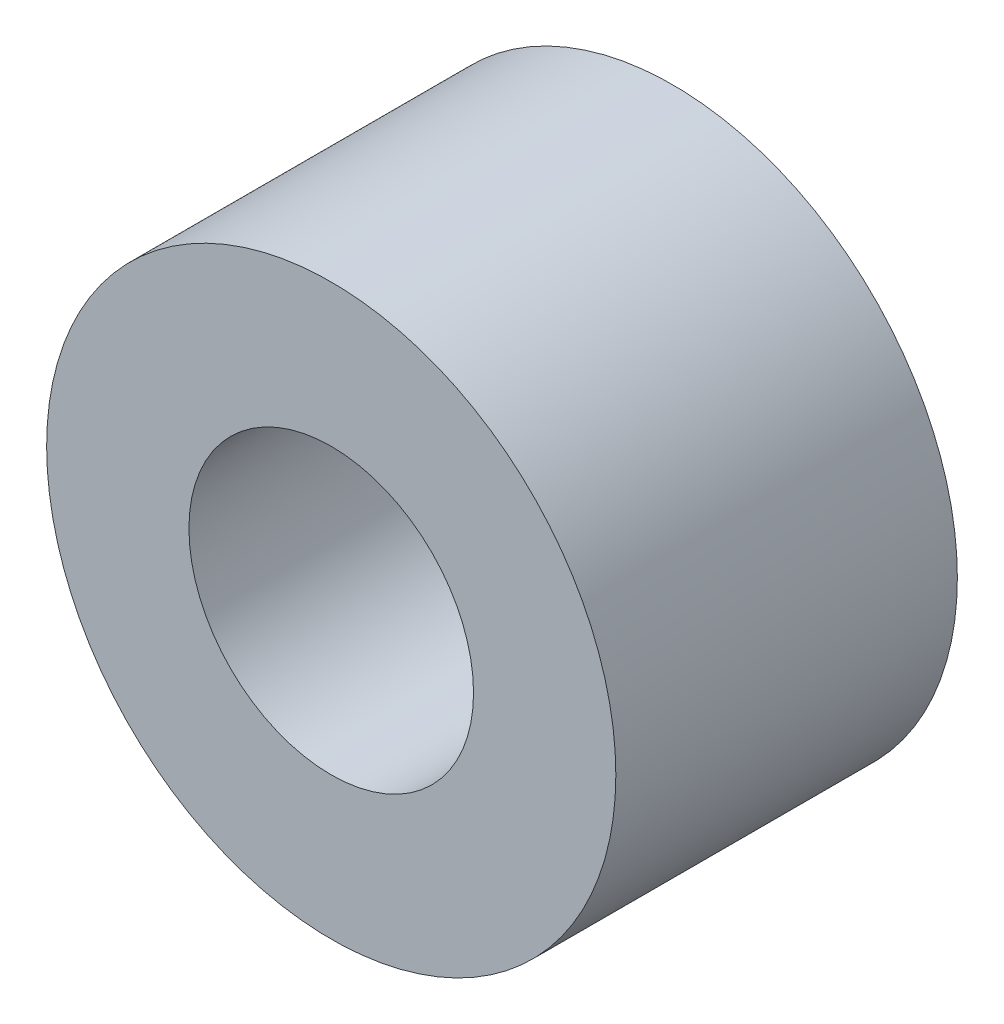
ISO-10303-21;
HEADER;
FILE_DESCRIPTION(('STEP AP214'),'2;1');
FILE_NAME('part.step','',(''),(''),'','','');
FILE_SCHEMA(('AUTOMOTIVE_DESIGN { 1 0 10303 214 1 1 1 1 }'));
ENDSEC;
DATA;
#1=APPLICATION_CONTEXT('core data for automotive mechanical design processes');
#2=APPLICATION_PROTOCOL_DEFINITION('international standard','automotive_design',2000,#1);
#3=PRODUCT_CONTEXT('',#1,'mechanical');
#4=PRODUCT('Part','Part','',(#3));
#5=PRODUCT_RELATED_PRODUCT_CATEGORY('part','',(#4));
#6=PRODUCT_DEFINITION_FORMATION('','',#4);
#7=PRODUCT_DEFINITION_CONTEXT('part definition',#1,'design');
#8=PRODUCT_DEFINITION('design','',#6,#7);
#9=PRODUCT_DEFINITION_SHAPE('','',#8);
#10=(LENGTH_UNIT() NAMED_UNIT(*) SI_UNIT(.MILLI.,.METRE.));
#11=(NAMED_UNIT(*) PLANE_ANGLE_UNIT() SI_UNIT($,.RADIAN.));
#12=(NAMED_UNIT(*) SI_UNIT($,.STERADIAN.) SOLID_ANGLE_UNIT());
#13=UNCERTAINTY_MEASURE_WITH_UNIT(LENGTH_MEASURE(1.E-05),#10,'distance_accuracy_value','');
#14=(GEOMETRIC_REPRESENTATION_CONTEXT(3) GLOBAL_UNCERTAINTY_ASSIGNED_CONTEXT((#13)) GLOBAL_UNIT_ASSIGNED_CONTEXT((#10,
#11,#12)) REPRESENTATION_CONTEXT('',''));
#15=CARTESIAN_POINT('',(0.,0.,0.));
#16=DIRECTION('',(0.,0.,1.));
#17=DIRECTION('',(1.,0.,0.));
#18=AXIS2_PLACEMENT_3D('',#15,#16,#17);
#19=CARTESIAN_POINT('',(0.,0.,6.));
#20=DIRECTION('',(0.,0.,1.));
#21=DIRECTION('',(1.,0.,0.));
#22=AXIS2_PLACEMENT_3D('',#19,#20,#21);
#23=PLANE('',#22);
#24=CARTESIAN_POINT('',(0.,0.,6.));
#25=DIRECTION('',(0.,0.,1.));
#26=DIRECTION('',(1.,0.,0.));
#27=AXIS2_PLACEMENT_3D('',#24,#25,#26);
#28=CIRCLE('',#27,5.);
#29=CARTESIAN_POINT('',(5.,0.,6.));
#30=VERTEX_POINT('',#29);
#31=EDGE_CURVE('E10',#30,#30,#28,.T.);
#32=ORIENTED_EDGE('',*,*,#31,.T.);
#33=EDGE_LOOP('',(#32));
#34=FACE_BOUND('',#33,.T.);
#35=CARTESIAN_POINT('',(0.,0.,6.));
#36=DIRECTION('',(0.,0.,1.));
#37=DIRECTION('',(1.,0.,0.));
#38=AXIS2_PLACEMENT_3D('',#35,#36,#37);
#39=CIRCLE('',#38,2.5);
#40=CARTESIAN_POINT('',(2.5,0.,6.));
#41=VERTEX_POINT('',#40);
#42=EDGE_CURVE('E45',#41,#41,#39,.T.);
#43=ORIENTED_EDGE('',*,*,#42,.F.);
#44=EDGE_LOOP('',(#43));
#45=FACE_BOUND('',#44,.T.);
#46=ADVANCED_FACE('F34',(#34,#45),#23,.T.);
#47=CARTESIAN_POINT('',(0.,0.,0.));
#48=DIRECTION('',(0.,0.,1.));
#49=DIRECTION('',(1.,0.,0.));
#50=AXIS2_PLACEMENT_3D('',#47,#48,#49);
#51=PLANE('',#50);
#52=CARTESIAN_POINT('',(0.,0.,0.));
#53=DIRECTION('',(0.,0.,1.));
#54=DIRECTION('',(1.,0.,0.));
#55=AXIS2_PLACEMENT_3D('',#52,#53,#54);
#56=CIRCLE('',#55,5.);
#57=CARTESIAN_POINT('',(5.,0.,0.));
#58=VERTEX_POINT('',#57);
#59=EDGE_CURVE('E38',#58,#58,#56,.T.);
#60=ORIENTED_EDGE('',*,*,#59,.F.);
#61=EDGE_LOOP('',(#60));
#62=FACE_BOUND('',#61,.T.);
#63=CARTESIAN_POINT('',(0.,0.,0.));
#64=DIRECTION('',(0.,0.,1.));
#65=DIRECTION('',(1.,0.,0.));
#66=AXIS2_PLACEMENT_3D('',#63,#64,#65);
#67=CIRCLE('',#66,2.5);
#68=CARTESIAN_POINT('',(2.5,0.,0.));
#69=VERTEX_POINT('',#68);
#70=EDGE_CURVE('E47',#69,#69,#67,.T.);
#71=ORIENTED_EDGE('',*,*,#70,.T.);
#72=EDGE_LOOP('',(#71));
#73=FACE_BOUND('',#72,.T.);
#74=ADVANCED_FACE('F57',(#62,#73),#51,.F.);
#75=CARTESIAN_POINT('',(0.,0.,6.));
#76=DIRECTION('',(0.,0.,-1.));
#77=DIRECTION('',(-1.,0.,0.));
#78=AXIS2_PLACEMENT_3D('',#75,#76,#77);
#79=CYLINDRICAL_SURFACE('',#78,5.);
#80=ORIENTED_EDGE('',*,*,#31,.F.);
#81=EDGE_LOOP('',(#80));
#82=FACE_BOUND('',#81,.T.);
#83=ORIENTED_EDGE('',*,*,#59,.T.);
#84=EDGE_LOOP('',(#83));
#85=FACE_BOUND('',#84,.T.);
#86=ADVANCED_FACE('F36',(#82,#85),#79,.T.);
#87=CARTESIAN_POINT('',(0.,0.,6.));
#88=DIRECTION('',(0.,0.,-1.));
#89=DIRECTION('',(-1.,0.,0.));
#90=AXIS2_PLACEMENT_3D('',#87,#88,#89);
#91=CYLINDRICAL_SURFACE('',#90,2.5);
#92=ORIENTED_EDGE('',*,*,#42,.T.);
#93=EDGE_LOOP('',(#92));
#94=FACE_BOUND('',#93,.T.);
#95=ORIENTED_EDGE('',*,*,#70,.F.);
#96=EDGE_LOOP('',(#95));
#97=FACE_BOUND('',#96,.T.);
#98=ADVANCED_FACE('F53',(#94,#97),#91,.F.);
#99=CLOSED_SHELL('',(#46,#74,#86,#98));
#100=MANIFOLD_SOLID_BREP('B2',#99);
#101=ADVANCED_BREP_SHAPE_REPRESENTATION('',(#18,#100),#14);
#102=SHAPE_DEFINITION_REPRESENTATION(#9,#101);
ENDSEC;
END-ISO-10303-21;
